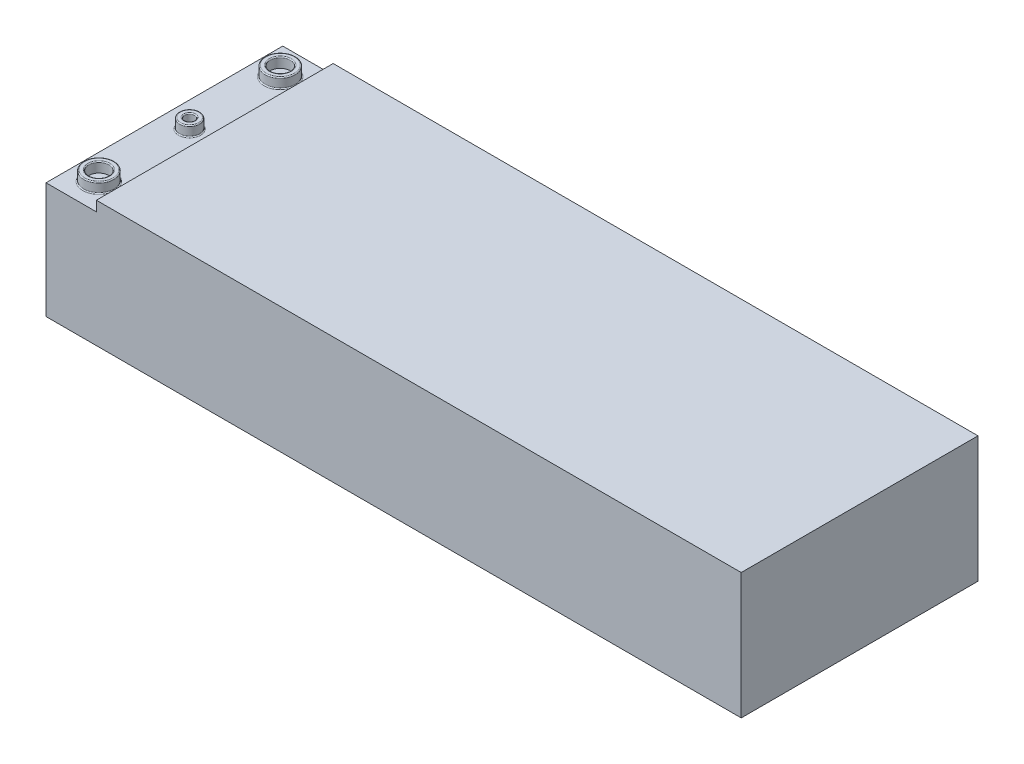
ISO-10303-21;
HEADER;
FILE_DESCRIPTION(('STEP AP214'),'2;1');
FILE_NAME('part.step','',(''),(''),'','','');
FILE_SCHEMA(('AUTOMOTIVE_DESIGN { 1 0 10303 214 1 1 1 1 }'));
ENDSEC;
DATA;
#1=APPLICATION_CONTEXT('core data for automotive mechanical design processes');
#2=APPLICATION_PROTOCOL_DEFINITION('international standard','automotive_design',2000,#1);
#3=PRODUCT_CONTEXT('',#1,'mechanical');
#4=PRODUCT('Part','Part','',(#3));
#5=PRODUCT_RELATED_PRODUCT_CATEGORY('part','',(#4));
#6=PRODUCT_DEFINITION_FORMATION('','',#4);
#7=PRODUCT_DEFINITION_CONTEXT('part definition',#1,'design');
#8=PRODUCT_DEFINITION('design','',#6,#7);
#9=PRODUCT_DEFINITION_SHAPE('','',#8);
#10=(LENGTH_UNIT() NAMED_UNIT(*) SI_UNIT(.MILLI.,.METRE.));
#11=(NAMED_UNIT(*) PLANE_ANGLE_UNIT() SI_UNIT($,.RADIAN.));
#12=(NAMED_UNIT(*) SI_UNIT($,.STERADIAN.) SOLID_ANGLE_UNIT());
#13=UNCERTAINTY_MEASURE_WITH_UNIT(LENGTH_MEASURE(1.E-05),#10,'distance_accuracy_value','');
#14=(GEOMETRIC_REPRESENTATION_CONTEXT(3) GLOBAL_UNCERTAINTY_ASSIGNED_CONTEXT((#13)) GLOBAL_UNIT_ASSIGNED_CONTEXT((#10,
#11,#12)) REPRESENTATION_CONTEXT('',''));
#15=CARTESIAN_POINT('',(0.,0.,0.));
#16=DIRECTION('',(0.,0.,1.));
#17=DIRECTION('',(1.,0.,0.));
#18=AXIS2_PLACEMENT_3D('',#15,#16,#17);
#19=CARTESIAN_POINT('',(69.,25.,23.5));
#20=DIRECTION('',(-1.,0.,0.));
#21=DIRECTION('',(0.,0.,1.));
#22=AXIS2_PLACEMENT_3D('',#19,#20,#21);
#23=PLANE('',#22);
#24=DIRECTION('',(0.,0.,-1.));
#25=VECTOR('',#24,1.);
#26=CARTESIAN_POINT('',(69.,0.,23.5));
#27=LINE('',#26,#25);
#28=CARTESIAN_POINT('',(69.,0.,23.5));
#29=VERTEX_POINT('',#28);
#30=CARTESIAN_POINT('',(69.,0.,-23.5));
#31=VERTEX_POINT('',#30);
#32=EDGE_CURVE('E97',#29,#31,#27,.T.);
#33=ORIENTED_EDGE('',*,*,#32,.T.);
#34=DIRECTION('',(0.,-1.,0.));
#35=VECTOR('',#34,1.);
#36=CARTESIAN_POINT('',(69.,25.,-23.5));
#37=LINE('',#36,#35);
#38=CARTESIAN_POINT('',(69.,25.,-23.5));
#39=VERTEX_POINT('',#38);
#40=EDGE_CURVE('E115',#39,#31,#37,.T.);
#41=ORIENTED_EDGE('',*,*,#40,.F.);
#42=DIRECTION('',(0.,0.,-1.));
#43=VECTOR('',#42,1.);
#44=CARTESIAN_POINT('',(69.,25.,23.5));
#45=LINE('',#44,#43);
#46=CARTESIAN_POINT('',(69.,25.,23.5));
#47=VERTEX_POINT('',#46);
#48=EDGE_CURVE('E91',#47,#39,#45,.T.);
#49=ORIENTED_EDGE('',*,*,#48,.F.);
#50=DIRECTION('',(0.,-1.,0.));
#51=VECTOR('',#50,1.);
#52=CARTESIAN_POINT('',(69.,25.,23.5));
#53=LINE('',#52,#51);
#54=EDGE_CURVE('E82',#47,#29,#53,.T.);
#55=ORIENTED_EDGE('',*,*,#54,.T.);
#56=EDGE_LOOP('',(#33,#41,#49,#55));
#57=FACE_BOUND('',#56,.T.);
#58=ADVANCED_FACE('F37',(#57),#23,.F.);
#59=CARTESIAN_POINT('',(-69.,25.,-23.5));
#60=DIRECTION('',(0.,0.,1.));
#61=DIRECTION('',(1.,0.,0.));
#62=AXIS2_PLACEMENT_3D('',#59,#60,#61);
#63=PLANE('',#62);
#64=DIRECTION('',(1.,0.,0.));
#65=VECTOR('',#64,1.);
#66=CARTESIAN_POINT('',(-69.,23.,-23.5));
#67=LINE('',#66,#65);
#68=CARTESIAN_POINT('',(-69.,23.,-23.5));
#69=VERTEX_POINT('',#68);
#70=CARTESIAN_POINT('',(-59.,23.,-23.5));
#71=VERTEX_POINT('',#70);
#72=EDGE_CURVE('E296',#69,#71,#67,.T.);
#73=ORIENTED_EDGE('',*,*,#72,.T.);
#74=DIRECTION('',(0.,1.,0.));
#75=VECTOR('',#74,1.);
#76=CARTESIAN_POINT('',(-59.,25.,-23.5));
#77=LINE('',#76,#75);
#78=CARTESIAN_POINT('',(-59.,25.,-23.5));
#79=VERTEX_POINT('',#78);
#80=EDGE_CURVE('E299',#71,#79,#77,.T.);
#81=ORIENTED_EDGE('',*,*,#80,.T.);
#82=DIRECTION('',(-1.,0.,0.));
#83=VECTOR('',#82,1.);
#84=CARTESIAN_POINT('',(-69.,25.,-23.5));
#85=LINE('',#84,#83);
#86=EDGE_CURVE('E311',#39,#79,#85,.T.);
#87=ORIENTED_EDGE('',*,*,#86,.F.);
#88=ORIENTED_EDGE('',*,*,#40,.T.);
#89=DIRECTION('',(-1.,0.,0.));
#90=VECTOR('',#89,1.);
#91=CARTESIAN_POINT('',(-69.,0.,-23.5));
#92=LINE('',#91,#90);
#93=CARTESIAN_POINT('',(-69.,0.,-23.5));
#94=VERTEX_POINT('',#93);
#95=EDGE_CURVE('E101',#31,#94,#92,.T.);
#96=ORIENTED_EDGE('',*,*,#95,.T.);
#97=DIRECTION('',(0.,-1.,0.));
#98=VECTOR('',#97,1.);
#99=CARTESIAN_POINT('',(-69.,25.,-23.5));
#100=LINE('',#99,#98);
#101=EDGE_CURVE('E113',#69,#94,#100,.T.);
#102=ORIENTED_EDGE('',*,*,#101,.F.);
#103=EDGE_LOOP('',(#73,#81,#87,#88,#96,#102));
#104=FACE_BOUND('',#103,.T.);
#105=ADVANCED_FACE('F194',(#104),#63,.F.);
#106=CARTESIAN_POINT('',(-69.,25.,23.5));
#107=DIRECTION('',(1.,0.,0.));
#108=DIRECTION('',(0.,0.,-1.));
#109=AXIS2_PLACEMENT_3D('',#106,#107,#108);
#110=PLANE('',#109);
#111=DIRECTION('',(0.,-1.,0.));
#112=VECTOR('',#111,1.);
#113=CARTESIAN_POINT('',(-69.,25.,23.5));
#114=LINE('',#113,#112);
#115=CARTESIAN_POINT('',(-69.,23.,23.5));
#116=VERTEX_POINT('',#115);
#117=CARTESIAN_POINT('',(-69.,0.,23.5));
#118=VERTEX_POINT('',#117);
#119=EDGE_CURVE('E86',#116,#118,#114,.T.);
#120=ORIENTED_EDGE('',*,*,#119,.F.);
#121=DIRECTION('',(0.,0.,1.));
#122=VECTOR('',#121,1.);
#123=CARTESIAN_POINT('',(-69.,23.,-23.5));
#124=LINE('',#123,#122);
#125=EDGE_CURVE('E283',#69,#116,#124,.T.);
#126=ORIENTED_EDGE('',*,*,#125,.F.);
#127=ORIENTED_EDGE('',*,*,#101,.T.);
#128=DIRECTION('',(0.,0.,1.));
#129=VECTOR('',#128,1.);
#130=CARTESIAN_POINT('',(-69.,0.,23.5));
#131=LINE('',#130,#129);
#132=EDGE_CURVE('E92',#94,#118,#131,.T.);
#133=ORIENTED_EDGE('',*,*,#132,.T.);
#134=EDGE_LOOP('',(#120,#126,#127,#133));
#135=FACE_BOUND('',#134,.T.);
#136=ADVANCED_FACE('F199',(#135),#110,.F.);
#137=CARTESIAN_POINT('',(-69.,25.,23.5));
#138=DIRECTION('',(0.,0.,-1.));
#139=DIRECTION('',(-1.,0.,0.));
#140=AXIS2_PLACEMENT_3D('',#137,#138,#139);
#141=PLANE('',#140);
#142=DIRECTION('',(1.,0.,0.));
#143=VECTOR('',#142,1.);
#144=CARTESIAN_POINT('',(-69.,25.,23.5));
#145=LINE('',#144,#143);
#146=CARTESIAN_POINT('',(-59.,25.,23.5));
#147=VERTEX_POINT('',#146);
#148=EDGE_CURVE('E60',#147,#47,#145,.T.);
#149=ORIENTED_EDGE('',*,*,#148,.F.);
#150=DIRECTION('',(0.,1.,0.));
#151=VECTOR('',#150,1.);
#152=CARTESIAN_POINT('',(-59.,25.,23.5));
#153=LINE('',#152,#151);
#154=CARTESIAN_POINT('',(-59.,23.,23.5));
#155=VERTEX_POINT('',#154);
#156=EDGE_CURVE('E52',#155,#147,#153,.T.);
#157=ORIENTED_EDGE('',*,*,#156,.F.);
#158=DIRECTION('',(1.,0.,0.));
#159=VECTOR('',#158,1.);
#160=CARTESIAN_POINT('',(-69.,23.,23.5));
#161=LINE('',#160,#159);
#162=EDGE_CURVE('E302',#116,#155,#161,.T.);
#163=ORIENTED_EDGE('',*,*,#162,.F.);
#164=ORIENTED_EDGE('',*,*,#119,.T.);
#165=DIRECTION('',(1.,0.,0.));
#166=VECTOR('',#165,1.);
#167=CARTESIAN_POINT('',(-69.,0.,23.5));
#168=LINE('',#167,#166);
#169=EDGE_CURVE('E79',#118,#29,#168,.T.);
#170=ORIENTED_EDGE('',*,*,#169,.T.);
#171=ORIENTED_EDGE('',*,*,#54,.F.);
#172=EDGE_LOOP('',(#149,#157,#163,#164,#170,#171));
#173=FACE_BOUND('',#172,.T.);
#174=ADVANCED_FACE('F81',(#173),#141,.F.);
#175=CARTESIAN_POINT('',(0.,25.,0.));
#176=DIRECTION('',(0.,-1.,0.));
#177=DIRECTION('',(0.,0.,-1.));
#178=AXIS2_PLACEMENT_3D('',#175,#176,#177);
#179=PLANE('',#178);
#180=ORIENTED_EDGE('',*,*,#86,.T.);
#181=DIRECTION('',(0.,0.,1.));
#182=VECTOR('',#181,1.);
#183=CARTESIAN_POINT('',(-59.,25.,-23.5));
#184=LINE('',#183,#182);
#185=EDGE_CURVE('E103',#79,#147,#184,.T.);
#186=ORIENTED_EDGE('',*,*,#185,.T.);
#187=ORIENTED_EDGE('',*,*,#148,.T.);
#188=ORIENTED_EDGE('',*,*,#48,.T.);
#189=EDGE_LOOP('',(#180,#186,#187,#188));
#190=FACE_BOUND('',#189,.T.);
#191=ADVANCED_FACE('F269',(#190),#179,.F.);
#192=CARTESIAN_POINT('',(0.,0.,0.));
#193=DIRECTION('',(0.,-1.,0.));
#194=DIRECTION('',(0.,0.,-1.));
#195=AXIS2_PLACEMENT_3D('',#192,#193,#194);
#196=PLANE('',#195);
#197=ORIENTED_EDGE('',*,*,#32,.F.);
#198=ORIENTED_EDGE('',*,*,#169,.F.);
#199=ORIENTED_EDGE('',*,*,#132,.F.);
#200=ORIENTED_EDGE('',*,*,#95,.F.);
#201=EDGE_LOOP('',(#197,#198,#199,#200));
#202=FACE_BOUND('',#201,.T.);
#203=ADVANCED_FACE('F99',(#202),#196,.T.);
#204=CARTESIAN_POINT('',(-59.,25.,-23.5));
#205=DIRECTION('',(1.,0.,0.));
#206=DIRECTION('',(0.,1.,0.));
#207=AXIS2_PLACEMENT_3D('',#204,#205,#206);
#208=PLANE('',#207);
#209=ORIENTED_EDGE('',*,*,#156,.T.);
#210=ORIENTED_EDGE('',*,*,#185,.F.);
#211=ORIENTED_EDGE('',*,*,#80,.F.);
#212=DIRECTION('',(0.,0.,1.));
#213=VECTOR('',#212,1.);
#214=CARTESIAN_POINT('',(-59.,23.,-23.5));
#215=LINE('',#214,#213);
#216=EDGE_CURVE('E106',#71,#155,#215,.T.);
#217=ORIENTED_EDGE('',*,*,#216,.T.);
#218=EDGE_LOOP('',(#209,#210,#211,#217));
#219=FACE_BOUND('',#218,.T.);
#220=ADVANCED_FACE('F263',(#219),#208,.F.);
#221=CARTESIAN_POINT('',(-69.,23.,-23.5));
#222=DIRECTION('',(0.,-1.,0.));
#223=DIRECTION('',(0.,0.,-1.));
#224=AXIS2_PLACEMENT_3D('',#221,#222,#223);
#225=PLANE('',#224);
#226=CARTESIAN_POINT('',(-64.,23.,0.));
#227=DIRECTION('',(0.,-1.,0.));
#228=DIRECTION('',(0.,0.,-1.));
#229=AXIS2_PLACEMENT_3D('',#226,#227,#228);
#230=CIRCLE('',#229,2.2);
#231=CARTESIAN_POINT('',(-64.,23.,-2.2));
#232=VERTEX_POINT('',#231);
#233=EDGE_CURVE('E11',#232,#232,#230,.T.);
#234=ORIENTED_EDGE('',*,*,#233,.T.);
#235=EDGE_LOOP('',(#234));
#236=FACE_BOUND('',#235,.T.);
#237=CARTESIAN_POINT('',(-64.0000000000001,23.,-18.));
#238=DIRECTION('',(0.,-1.,0.));
#239=DIRECTION('',(0.,0.,-1.));
#240=AXIS2_PLACEMENT_3D('',#237,#238,#239);
#241=CIRCLE('',#240,3.2);
#242=CARTESIAN_POINT('',(-64.0000000000001,23.,-21.2));
#243=VERTEX_POINT('',#242);
#244=EDGE_CURVE('E45',#243,#243,#241,.T.);
#245=ORIENTED_EDGE('',*,*,#244,.T.);
#246=EDGE_LOOP('',(#245));
#247=FACE_BOUND('',#246,.T.);
#248=CARTESIAN_POINT('',(-64.0000000000001,23.,18.));
#249=DIRECTION('',(0.,-1.,0.));
#250=DIRECTION('',(0.,0.,-1.));
#251=AXIS2_PLACEMENT_3D('',#248,#249,#250);
#252=CIRCLE('',#251,3.2);
#253=CARTESIAN_POINT('',(-64.0000000000001,23.,14.8));
#254=VERTEX_POINT('',#253);
#255=EDGE_CURVE('E162',#254,#254,#252,.T.);
#256=ORIENTED_EDGE('',*,*,#255,.T.);
#257=EDGE_LOOP('',(#256));
#258=FACE_BOUND('',#257,.T.);
#259=ORIENTED_EDGE('',*,*,#162,.T.);
#260=ORIENTED_EDGE('',*,*,#216,.F.);
#261=ORIENTED_EDGE('',*,*,#72,.F.);
#262=ORIENTED_EDGE('',*,*,#125,.T.);
#263=EDGE_LOOP('',(#259,#260,#261,#262));
#264=FACE_BOUND('',#263,.T.);
#265=ADVANCED_FACE('F167',(#236,#247,#258,#264),#225,.F.);
#266=CARTESIAN_POINT('',(-64.0000000000001,25.,18.));
#267=DIRECTION('',(0.,1.,0.));
#268=DIRECTION('',(0.,0.,1.));
#269=AXIS2_PLACEMENT_3D('',#266,#267,#268);
#270=PLANE('',#269);
#271=CARTESIAN_POINT('',(-64.0000000000001,25.,18.));
#272=DIRECTION('',(0.,1.,0.));
#273=DIRECTION('',(0.,0.,1.));
#274=AXIS2_PLACEMENT_3D('',#271,#272,#273);
#275=CIRCLE('',#274,2.2);
#276=CARTESIAN_POINT('',(-64.0000000000001,25.,20.2));
#277=VERTEX_POINT('',#276);
#278=EDGE_CURVE('E132',#277,#277,#275,.F.);
#279=ORIENTED_EDGE('',*,*,#278,.T.);
#280=EDGE_LOOP('',(#279));
#281=FACE_BOUND('',#280,.T.);
#282=CARTESIAN_POINT('',(-64.0000000000001,25.,18.));
#283=DIRECTION('',(0.,1.,0.));
#284=DIRECTION('',(0.,0.,1.));
#285=AXIS2_PLACEMENT_3D('',#282,#283,#284);
#286=CIRCLE('',#285,2.8);
#287=CARTESIAN_POINT('',(-64.0000000000001,25.,20.8));
#288=VERTEX_POINT('',#287);
#289=EDGE_CURVE('E129',#288,#288,#286,.T.);
#290=ORIENTED_EDGE('',*,*,#289,.T.);
#291=EDGE_LOOP('',(#290));
#292=FACE_BOUND('',#291,.T.);
#293=ADVANCED_FACE('F256',(#281,#292),#270,.T.);
#294=CARTESIAN_POINT('',(-64.0000000000001,25.,18.));
#295=DIRECTION('',(0.,-1.,0.));
#296=DIRECTION('',(0.,0.,-1.));
#297=AXIS2_PLACEMENT_3D('',#294,#295,#296);
#298=CYLINDRICAL_SURFACE('',#297,3.);
#299=CARTESIAN_POINT('',(-64.0000000000001,24.8,18.));
#300=DIRECTION('',(0.,1.,0.));
#301=DIRECTION('',(0.,0.,1.));
#302=AXIS2_PLACEMENT_3D('',#299,#300,#301);
#303=CIRCLE('',#302,3.);
#304=CARTESIAN_POINT('',(-64.0000000000001,24.8,21.));
#305=VERTEX_POINT('',#304);
#306=EDGE_CURVE('E153',#305,#305,#303,.F.);
#307=ORIENTED_EDGE('',*,*,#306,.T.);
#308=EDGE_LOOP('',(#307));
#309=FACE_BOUND('',#308,.T.);
#310=CARTESIAN_POINT('',(-64.0000000000001,23.2,18.));
#311=DIRECTION('',(0.,-1.,0.));
#312=DIRECTION('',(0.,0.,-1.));
#313=AXIS2_PLACEMENT_3D('',#310,#311,#312);
#314=CIRCLE('',#313,3.);
#315=CARTESIAN_POINT('',(-64.0000000000001,23.2,15.));
#316=VERTEX_POINT('',#315);
#317=EDGE_CURVE('E150',#316,#316,#314,.F.);
#318=ORIENTED_EDGE('',*,*,#317,.T.);
#319=EDGE_LOOP('',(#318));
#320=FACE_BOUND('',#319,.T.);
#321=ADVANCED_FACE('F254',(#309,#320),#298,.T.);
#322=CARTESIAN_POINT('',(-64.0000000000001,25.,18.));
#323=DIRECTION('',(0.,-1.,0.));
#324=DIRECTION('',(0.,0.,-1.));
#325=AXIS2_PLACEMENT_3D('',#322,#323,#324);
#326=CYLINDRICAL_SURFACE('',#325,2.);
#327=CARTESIAN_POINT('',(-64.0000000000001,24.8,18.));
#328=DIRECTION('',(0.,1.,0.));
#329=DIRECTION('',(0.,0.,1.));
#330=AXIS2_PLACEMENT_3D('',#327,#328,#329);
#331=CIRCLE('',#330,2.);
#332=CARTESIAN_POINT('',(-64.0000000000001,24.8,20.));
#333=VERTEX_POINT('',#332);
#334=EDGE_CURVE('E126',#333,#333,#331,.T.);
#335=ORIENTED_EDGE('',*,*,#334,.T.);
#336=EDGE_LOOP('',(#335));
#337=FACE_BOUND('',#336,.T.);
#338=CARTESIAN_POINT('',(-64.0000000000001,23.,18.));
#339=DIRECTION('',(0.,1.,0.));
#340=DIRECTION('',(0.,0.,1.));
#341=AXIS2_PLACEMENT_3D('',#338,#339,#340);
#342=CIRCLE('',#341,2.);
#343=CARTESIAN_POINT('',(-64.0000000000001,23.,20.));
#344=VERTEX_POINT('',#343);
#345=EDGE_CURVE('E305',#344,#344,#342,.T.);
#346=ORIENTED_EDGE('',*,*,#345,.F.);
#347=EDGE_LOOP('',(#346));
#348=FACE_BOUND('',#347,.T.);
#349=ADVANCED_FACE('F251',(#337,#348),#326,.F.);
#350=ORIENTED_EDGE('',*,*,#345,.T.);
#351=EDGE_LOOP('',(#350));
#352=FACE_BOUND('',#351,.T.);
#353=ADVANCED_FACE('F247',(#352),#225,.F.);
#354=CARTESIAN_POINT('',(-64.,25.,0.));
#355=DIRECTION('',(0.,1.,0.));
#356=DIRECTION('',(0.,0.,1.));
#357=AXIS2_PLACEMENT_3D('',#354,#355,#356);
#358=PLANE('',#357);
#359=CARTESIAN_POINT('',(-64.,25.,0.));
#360=DIRECTION('',(0.,1.,0.));
#361=DIRECTION('',(0.,0.,1.));
#362=AXIS2_PLACEMENT_3D('',#359,#360,#361);
#363=CIRCLE('',#362,1.2);
#364=CARTESIAN_POINT('',(-64.,25.,1.2));
#365=VERTEX_POINT('',#364);
#366=EDGE_CURVE('E123',#365,#365,#363,.F.);
#367=ORIENTED_EDGE('',*,*,#366,.T.);
#368=EDGE_LOOP('',(#367));
#369=FACE_BOUND('',#368,.T.);
#370=CARTESIAN_POINT('',(-64.,25.,0.));
#371=DIRECTION('',(0.,1.,0.));
#372=DIRECTION('',(0.,0.,1.));
#373=AXIS2_PLACEMENT_3D('',#370,#371,#372);
#374=CIRCLE('',#373,1.8);
#375=CARTESIAN_POINT('',(-64.,25.,1.8));
#376=VERTEX_POINT('',#375);
#377=EDGE_CURVE('E120',#376,#376,#374,.T.);
#378=ORIENTED_EDGE('',*,*,#377,.T.);
#379=EDGE_LOOP('',(#378));
#380=FACE_BOUND('',#379,.T.);
#381=ADVANCED_FACE('F239',(#369,#380),#358,.T.);
#382=CARTESIAN_POINT('',(-64.,25.,0.));
#383=DIRECTION('',(0.,-1.,0.));
#384=DIRECTION('',(0.,0.,-1.));
#385=AXIS2_PLACEMENT_3D('',#382,#383,#384);
#386=CYLINDRICAL_SURFACE('',#385,2.);
#387=CARTESIAN_POINT('',(-64.,24.8,0.));
#388=DIRECTION('',(0.,1.,0.));
#389=DIRECTION('',(0.,0.,1.));
#390=AXIS2_PLACEMENT_3D('',#387,#388,#389);
#391=CIRCLE('',#390,2.);
#392=CARTESIAN_POINT('',(-64.,24.8,2.));
#393=VERTEX_POINT('',#392);
#394=EDGE_CURVE('E159',#393,#393,#391,.F.);
#395=ORIENTED_EDGE('',*,*,#394,.T.);
#396=EDGE_LOOP('',(#395));
#397=FACE_BOUND('',#396,.T.);
#398=CARTESIAN_POINT('',(-64.,23.2,0.));
#399=DIRECTION('',(0.,-1.,0.));
#400=DIRECTION('',(0.,0.,-1.));
#401=AXIS2_PLACEMENT_3D('',#398,#399,#400);
#402=CIRCLE('',#401,2.);
#403=CARTESIAN_POINT('',(-64.,23.2,-2.));
#404=VERTEX_POINT('',#403);
#405=EDGE_CURVE('E156',#404,#404,#402,.F.);
#406=ORIENTED_EDGE('',*,*,#405,.T.);
#407=EDGE_LOOP('',(#406));
#408=FACE_BOUND('',#407,.T.);
#409=ADVANCED_FACE('F236',(#397,#408),#386,.T.);
#410=CARTESIAN_POINT('',(-64.,25.,0.));
#411=DIRECTION('',(0.,-1.,0.));
#412=DIRECTION('',(0.,0.,-1.));
#413=AXIS2_PLACEMENT_3D('',#410,#411,#412);
#414=CYLINDRICAL_SURFACE('',#413,0.999999999999998);
#415=CARTESIAN_POINT('',(-64.,24.8,0.));
#416=DIRECTION('',(0.,1.,0.));
#417=DIRECTION('',(0.,0.,1.));
#418=AXIS2_PLACEMENT_3D('',#415,#416,#417);
#419=CIRCLE('',#418,0.999999999999998);
#420=CARTESIAN_POINT('',(-64.,24.8,0.999999999999998));
#421=VERTEX_POINT('',#420);
#422=EDGE_CURVE('E117',#421,#421,#419,.T.);
#423=ORIENTED_EDGE('',*,*,#422,.T.);
#424=EDGE_LOOP('',(#423));
#425=FACE_BOUND('',#424,.T.);
#426=CARTESIAN_POINT('',(-64.,23.,0.));
#427=DIRECTION('',(0.,1.,0.));
#428=DIRECTION('',(0.,0.,1.));
#429=AXIS2_PLACEMENT_3D('',#426,#427,#428);
#430=CIRCLE('',#429,0.999999999999998);
#431=CARTESIAN_POINT('',(-64.,23.,0.999999999999998));
#432=VERTEX_POINT('',#431);
#433=EDGE_CURVE('E314',#432,#432,#430,.T.);
#434=ORIENTED_EDGE('',*,*,#433,.F.);
#435=EDGE_LOOP('',(#434));
#436=FACE_BOUND('',#435,.T.);
#437=ADVANCED_FACE('F238',(#425,#436),#414,.F.);
#438=ORIENTED_EDGE('',*,*,#433,.T.);
#439=EDGE_LOOP('',(#438));
#440=FACE_BOUND('',#439,.T.);
#441=ADVANCED_FACE('F189',(#440),#225,.F.);
#442=CARTESIAN_POINT('',(-64.0000000000001,25.,-18.));
#443=DIRECTION('',(0.,1.,0.));
#444=DIRECTION('',(0.,0.,1.));
#445=AXIS2_PLACEMENT_3D('',#442,#443,#444);
#446=PLANE('',#445);
#447=CARTESIAN_POINT('',(-64.0000000000001,25.,-18.));
#448=DIRECTION('',(0.,1.,0.));
#449=DIRECTION('',(0.,0.,1.));
#450=AXIS2_PLACEMENT_3D('',#447,#448,#449);
#451=CIRCLE('',#450,2.2);
#452=CARTESIAN_POINT('',(-64.0000000000001,25.,-15.8));
#453=VERTEX_POINT('',#452);
#454=EDGE_CURVE('E141',#453,#453,#451,.F.);
#455=ORIENTED_EDGE('',*,*,#454,.T.);
#456=EDGE_LOOP('',(#455));
#457=FACE_BOUND('',#456,.T.);
#458=CARTESIAN_POINT('',(-64.0000000000001,25.,-18.));
#459=DIRECTION('',(0.,1.,0.));
#460=DIRECTION('',(0.,0.,1.));
#461=AXIS2_PLACEMENT_3D('',#458,#459,#460);
#462=CIRCLE('',#461,2.8);
#463=CARTESIAN_POINT('',(-64.0000000000001,25.,-15.2));
#464=VERTEX_POINT('',#463);
#465=EDGE_CURVE('E138',#464,#464,#462,.T.);
#466=ORIENTED_EDGE('',*,*,#465,.T.);
#467=EDGE_LOOP('',(#466));
#468=FACE_BOUND('',#467,.T.);
#469=ADVANCED_FACE('F179',(#457,#468),#446,.T.);
#470=CARTESIAN_POINT('',(-64.0000000000001,25.,-18.));
#471=DIRECTION('',(0.,-1.,0.));
#472=DIRECTION('',(0.,0.,-1.));
#473=AXIS2_PLACEMENT_3D('',#470,#471,#472);
#474=CYLINDRICAL_SURFACE('',#473,3.);
#475=CARTESIAN_POINT('',(-64.0000000000001,24.8,-18.));
#476=DIRECTION('',(0.,1.,0.));
#477=DIRECTION('',(0.,0.,1.));
#478=AXIS2_PLACEMENT_3D('',#475,#476,#477);
#479=CIRCLE('',#478,3.);
#480=CARTESIAN_POINT('',(-64.0000000000001,24.8,-15.));
#481=VERTEX_POINT('',#480);
#482=EDGE_CURVE('E147',#481,#481,#479,.F.);
#483=ORIENTED_EDGE('',*,*,#482,.T.);
#484=EDGE_LOOP('',(#483));
#485=FACE_BOUND('',#484,.T.);
#486=CARTESIAN_POINT('',(-64.0000000000001,23.2,-18.));
#487=DIRECTION('',(0.,-1.,0.));
#488=DIRECTION('',(0.,0.,-1.));
#489=AXIS2_PLACEMENT_3D('',#486,#487,#488);
#490=CIRCLE('',#489,3.);
#491=CARTESIAN_POINT('',(-64.0000000000001,23.2,-21.));
#492=VERTEX_POINT('',#491);
#493=EDGE_CURVE('E144',#492,#492,#490,.F.);
#494=ORIENTED_EDGE('',*,*,#493,.T.);
#495=EDGE_LOOP('',(#494));
#496=FACE_BOUND('',#495,.T.);
#497=ADVANCED_FACE('F176',(#485,#496),#474,.T.);
#498=CARTESIAN_POINT('',(-64.0000000000001,25.,-18.));
#499=DIRECTION('',(0.,-1.,0.));
#500=DIRECTION('',(0.,0.,-1.));
#501=AXIS2_PLACEMENT_3D('',#498,#499,#500);
#502=CYLINDRICAL_SURFACE('',#501,2.);
#503=CARTESIAN_POINT('',(-64.0000000000001,24.8,-18.));
#504=DIRECTION('',(0.,1.,0.));
#505=DIRECTION('',(0.,0.,1.));
#506=AXIS2_PLACEMENT_3D('',#503,#504,#505);
#507=CIRCLE('',#506,2.);
#508=CARTESIAN_POINT('',(-64.0000000000001,24.8,-16.));
#509=VERTEX_POINT('',#508);
#510=EDGE_CURVE('E135',#509,#509,#507,.T.);
#511=ORIENTED_EDGE('',*,*,#510,.T.);
#512=EDGE_LOOP('',(#511));
#513=FACE_BOUND('',#512,.T.);
#514=CARTESIAN_POINT('',(-64.0000000000001,23.,-18.));
#515=DIRECTION('',(0.,1.,0.));
#516=DIRECTION('',(0.,0.,1.));
#517=AXIS2_PLACEMENT_3D('',#514,#515,#516);
#518=CIRCLE('',#517,2.);
#519=CARTESIAN_POINT('',(-64.0000000000001,23.,-16.));
#520=VERTEX_POINT('',#519);
#521=EDGE_CURVE('E318',#520,#520,#518,.T.);
#522=ORIENTED_EDGE('',*,*,#521,.F.);
#523=EDGE_LOOP('',(#522));
#524=FACE_BOUND('',#523,.T.);
#525=ADVANCED_FACE('F178',(#513,#524),#502,.F.);
#526=ORIENTED_EDGE('',*,*,#521,.T.);
#527=EDGE_LOOP('',(#526));
#528=FACE_BOUND('',#527,.T.);
#529=ADVANCED_FACE('F186',(#528),#225,.F.);
#530=CARTESIAN_POINT('',(-64.,24.8,0.));
#531=DIRECTION('',(0.,1.,0.));
#532=DIRECTION('',(0.,0.,1.));
#533=AXIS2_PLACEMENT_3D('',#530,#531,#532);
#534=TOROIDAL_SURFACE('',#533,1.2,0.2);
#535=ORIENTED_EDGE('',*,*,#366,.F.);
#536=EDGE_LOOP('',(#535));
#537=FACE_BOUND('',#536,.T.);
#538=ORIENTED_EDGE('',*,*,#422,.F.);
#539=EDGE_LOOP('',(#538));
#540=FACE_BOUND('',#539,.T.);
#541=ADVANCED_FACE('F204',(#537,#540),#534,.T.);
#542=CARTESIAN_POINT('',(-64.0000000000001,24.8,18.));
#543=DIRECTION('',(0.,1.,0.));
#544=DIRECTION('',(0.,0.,1.));
#545=AXIS2_PLACEMENT_3D('',#542,#543,#544);
#546=TOROIDAL_SURFACE('',#545,2.2,0.2);
#547=ORIENTED_EDGE('',*,*,#278,.F.);
#548=EDGE_LOOP('',(#547));
#549=FACE_BOUND('',#548,.T.);
#550=ORIENTED_EDGE('',*,*,#334,.F.);
#551=EDGE_LOOP('',(#550));
#552=FACE_BOUND('',#551,.T.);
#553=ADVANCED_FACE('F207',(#549,#552),#546,.T.);
#554=CARTESIAN_POINT('',(-64.0000000000001,24.8,-18.));
#555=DIRECTION('',(0.,1.,0.));
#556=DIRECTION('',(0.,0.,1.));
#557=AXIS2_PLACEMENT_3D('',#554,#555,#556);
#558=TOROIDAL_SURFACE('',#557,2.2,0.2);
#559=ORIENTED_EDGE('',*,*,#454,.F.);
#560=EDGE_LOOP('',(#559));
#561=FACE_BOUND('',#560,.T.);
#562=ORIENTED_EDGE('',*,*,#510,.F.);
#563=EDGE_LOOP('',(#562));
#564=FACE_BOUND('',#563,.T.);
#565=ADVANCED_FACE('F211',(#561,#564),#558,.T.);
#566=CARTESIAN_POINT('',(-64.0000000000001,24.8,-18.));
#567=DIRECTION('',(0.,1.,0.));
#568=DIRECTION('',(0.,0.,1.));
#569=AXIS2_PLACEMENT_3D('',#566,#567,#568);
#570=TOROIDAL_SURFACE('',#569,2.8,0.2);
#571=ORIENTED_EDGE('',*,*,#482,.F.);
#572=EDGE_LOOP('',(#571));
#573=FACE_BOUND('',#572,.T.);
#574=ORIENTED_EDGE('',*,*,#465,.F.);
#575=EDGE_LOOP('',(#574));
#576=FACE_BOUND('',#575,.T.);
#577=ADVANCED_FACE('F215',(#573,#576),#570,.T.);
#578=CARTESIAN_POINT('',(-64.0000000000001,24.8,18.));
#579=DIRECTION('',(0.,1.,0.));
#580=DIRECTION('',(0.,0.,1.));
#581=AXIS2_PLACEMENT_3D('',#578,#579,#580);
#582=TOROIDAL_SURFACE('',#581,2.8,0.2);
#583=ORIENTED_EDGE('',*,*,#306,.F.);
#584=EDGE_LOOP('',(#583));
#585=FACE_BOUND('',#584,.T.);
#586=ORIENTED_EDGE('',*,*,#289,.F.);
#587=EDGE_LOOP('',(#586));
#588=FACE_BOUND('',#587,.T.);
#589=ADVANCED_FACE('F219',(#585,#588),#582,.T.);
#590=CARTESIAN_POINT('',(-64.,24.8,0.));
#591=DIRECTION('',(0.,1.,0.));
#592=DIRECTION('',(0.,0.,1.));
#593=AXIS2_PLACEMENT_3D('',#590,#591,#592);
#594=TOROIDAL_SURFACE('',#593,1.8,0.2);
#595=ORIENTED_EDGE('',*,*,#394,.F.);
#596=EDGE_LOOP('',(#595));
#597=FACE_BOUND('',#596,.T.);
#598=ORIENTED_EDGE('',*,*,#377,.F.);
#599=EDGE_LOOP('',(#598));
#600=FACE_BOUND('',#599,.T.);
#601=ADVANCED_FACE('F223',(#597,#600),#594,.T.);
#602=CARTESIAN_POINT('',(-64.,23.2,0.));
#603=DIRECTION('',(0.,-1.,0.));
#604=DIRECTION('',(0.,0.,-1.));
#605=AXIS2_PLACEMENT_3D('',#602,#603,#604);
#606=TOROIDAL_SURFACE('',#605,2.2,0.2);
#607=ORIENTED_EDGE('',*,*,#233,.F.);
#608=EDGE_LOOP('',(#607));
#609=FACE_BOUND('',#608,.T.);
#610=ORIENTED_EDGE('',*,*,#405,.F.);
#611=EDGE_LOOP('',(#610));
#612=FACE_BOUND('',#611,.T.);
#613=ADVANCED_FACE('F173',(#609,#612),#606,.F.);
#614=CARTESIAN_POINT('',(-64.0000000000001,23.2,-18.));
#615=DIRECTION('',(0.,-1.,0.));
#616=DIRECTION('',(0.,0.,-1.));
#617=AXIS2_PLACEMENT_3D('',#614,#615,#616);
#618=TOROIDAL_SURFACE('',#617,3.2,0.2);
#619=ORIENTED_EDGE('',*,*,#244,.F.);
#620=EDGE_LOOP('',(#619));
#621=FACE_BOUND('',#620,.T.);
#622=ORIENTED_EDGE('',*,*,#493,.F.);
#623=EDGE_LOOP('',(#622));
#624=FACE_BOUND('',#623,.T.);
#625=ADVANCED_FACE('F170',(#621,#624),#618,.F.);
#626=CARTESIAN_POINT('',(-64.0000000000001,23.2,18.));
#627=DIRECTION('',(0.,-1.,0.));
#628=DIRECTION('',(0.,0.,-1.));
#629=AXIS2_PLACEMENT_3D('',#626,#627,#628);
#630=TOROIDAL_SURFACE('',#629,3.2,0.2);
#631=ORIENTED_EDGE('',*,*,#255,.F.);
#632=EDGE_LOOP('',(#631));
#633=FACE_BOUND('',#632,.T.);
#634=ORIENTED_EDGE('',*,*,#317,.F.);
#635=EDGE_LOOP('',(#634));
#636=FACE_BOUND('',#635,.T.);
#637=ADVANCED_FACE('F39',(#633,#636),#630,.F.);
#638=CLOSED_SHELL('',(#58,#105,#136,#174,#191,#203,#220,#265,#293,#321,#349,#353,#381,#409,#437,
#441,#469,#497,#525,#529,#541,#553,#565,#577,#589,#601,#613,#625,#637));
#639=MANIFOLD_SOLID_BREP('B2',#638);
#640=ADVANCED_BREP_SHAPE_REPRESENTATION('',(#18,#639),#14);
#641=SHAPE_DEFINITION_REPRESENTATION(#9,#640);
ENDSEC;
END-ISO-10303-21;
